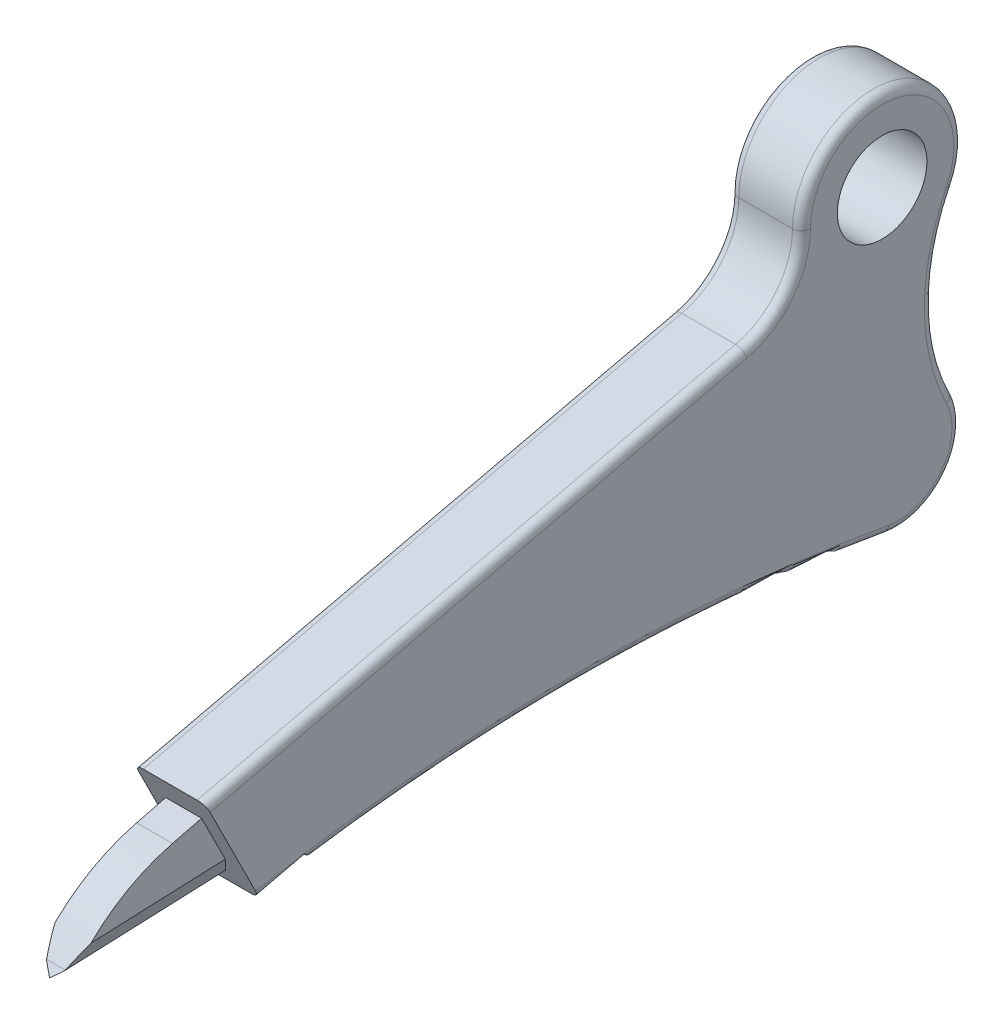
ISO-10303-21;
HEADER;
FILE_DESCRIPTION(('STEP AP214'),'2;1');
FILE_NAME('part.step','',(''),(''),'','','');
FILE_SCHEMA(('AUTOMOTIVE_DESIGN { 1 0 10303 214 1 1 1 1 }'));
ENDSEC;
DATA;
#1=APPLICATION_CONTEXT('core data for automotive mechanical design processes');
#2=APPLICATION_PROTOCOL_DEFINITION('international standard','automotive_design',2000,#1);
#3=PRODUCT_CONTEXT('',#1,'mechanical');
#4=PRODUCT('Part','Part','',(#3));
#5=PRODUCT_RELATED_PRODUCT_CATEGORY('part','',(#4));
#6=PRODUCT_DEFINITION_FORMATION('','',#4);
#7=PRODUCT_DEFINITION_CONTEXT('part definition',#1,'design');
#8=PRODUCT_DEFINITION('design','',#6,#7);
#9=PRODUCT_DEFINITION_SHAPE('','',#8);
#10=(LENGTH_UNIT() NAMED_UNIT(*) SI_UNIT(.MILLI.,.METRE.));
#11=(NAMED_UNIT(*) PLANE_ANGLE_UNIT() SI_UNIT($,.RADIAN.));
#12=(NAMED_UNIT(*) SI_UNIT($,.STERADIAN.) SOLID_ANGLE_UNIT());
#13=UNCERTAINTY_MEASURE_WITH_UNIT(LENGTH_MEASURE(1.E-05),#10,'distance_accuracy_value','');
#14=(GEOMETRIC_REPRESENTATION_CONTEXT(3) GLOBAL_UNCERTAINTY_ASSIGNED_CONTEXT((#13)) GLOBAL_UNIT_ASSIGNED_CONTEXT((#10,
#11,#12)) REPRESENTATION_CONTEXT('',''));
#15=CARTESIAN_POINT('',(0.,0.,0.));
#16=DIRECTION('',(0.,0.,1.));
#17=DIRECTION('',(1.,0.,0.));
#18=AXIS2_PLACEMENT_3D('',#15,#16,#17);
#19=CARTESIAN_POINT('',(5.08,0.,21.8621874453234));
#20=DIRECTION('',(1.,0.,0.));
#21=DIRECTION('',(0.,0.,-1.));
#22=AXIS2_PLACEMENT_3D('',#19,#20,#21);
#23=PLANE('',#22);
#24=DIRECTION('',(0.,-0.894427190999916,-0.447213595499959));
#25=VECTOR('',#24,1.);
#26=CARTESIAN_POINT('',(5.08,-43.18,88.1774609571593));
#27=LINE('',#26,#25);
#28=CARTESIAN_POINT('',(5.08,-29.1079464923485,95.2134877109851));
#29=VERTEX_POINT('',#28);
#30=CARTESIAN_POINT('',(5.08,-41.9956321296084,88.7696448923551));
#31=VERTEX_POINT('',#30);
#32=EDGE_CURVE('E330',#29,#31,#27,.T.);
#33=ORIENTED_EDGE('',*,*,#32,.T.);
#34=CARTESIAN_POINT('',(5.08,-293.260382077443,43.7274609571594));
#35=DIRECTION('',(1.,0.,0.));
#36=DIRECTION('',(0.,0.,-1.));
#37=AXIS2_PLACEMENT_3D('',#34,#35,#36);
#38=CIRCLE('',#37,255.27);
#39=CARTESIAN_POINT('',(5.08,-41.9295980896128,-0.944789042840671));
#40=VERTEX_POINT('',#39);
#41=EDGE_CURVE('E703',#31,#40,#38,.F.);
#42=ORIENTED_EDGE('',*,*,#41,.T.);
#43=CARTESIAN_POINT('',(5.08,-34.4298905377637,-2.27780844208511));
#44=DIRECTION('',(1.,0.,0.));
#45=DIRECTION('',(0.,0.,-1.));
#46=AXIS2_PLACEMENT_3D('',#43,#44,#45);
#47=CIRCLE('',#46,7.61725370996823);
#48=CARTESIAN_POINT('',(5.08,-31.0444444444444,-9.10139319141257));
#49=VERTEX_POINT('',#48);
#50=EDGE_CURVE('E225',#40,#49,#47,.T.);
#51=ORIENTED_EDGE('',*,*,#50,.T.);
#52=CARTESIAN_POINT('',(5.08,-17.78,-35.8367356911871));
#53=DIRECTION('',(1.,0.,0.));
#54=DIRECTION('',(0.,0.,-1.));
#55=AXIS2_PLACEMENT_3D('',#52,#53,#54);
#56=CIRCLE('',#55,29.845);
#57=CARTESIAN_POINT('',(5.08,-4.51555555555555,-9.10139319141259));
#58=VERTEX_POINT('',#57);
#59=EDGE_CURVE('E687',#49,#58,#56,.F.);
#60=ORIENTED_EDGE('',*,*,#59,.T.);
#61=CARTESIAN_POINT('',(5.08,0.,0.));
#62=DIRECTION('',(1.,0.,0.));
#63=DIRECTION('',(0.,0.,-1.));
#64=AXIS2_PLACEMENT_3D('',#61,#62,#63);
#65=CIRCLE('',#64,10.16);
#66=CARTESIAN_POINT('',(5.08,0.,10.16));
#67=VERTEX_POINT('',#66);
#68=EDGE_CURVE('E692',#58,#67,#65,.T.);
#69=ORIENTED_EDGE('',*,*,#68,.T.);
#70=CARTESIAN_POINT('',(5.08,0.,21.8621874453234));
#71=DIRECTION('',(1.,0.,0.));
#72=DIRECTION('',(0.,0.,-1.));
#73=AXIS2_PLACEMENT_3D('',#70,#71,#72);
#74=CIRCLE('',#73,11.7021874453234);
#75=CARTESIAN_POINT('',(5.08,-11.396864278717,19.2065000356326));
#76=VERTEX_POINT('',#75);
#77=EDGE_CURVE('E695',#67,#76,#74,.F.);
#78=ORIENTED_EDGE('',*,*,#77,.T.);
#79=DIRECTION('',(0.,-0.226939401039256,0.973908880879492));
#80=VECTOR('',#79,1.);
#81=CARTESIAN_POINT('',(5.08,-29.176864278717,95.5092479178395));
#82=LINE('',#81,#80);
#83=EDGE_CURVE('E698',#76,#29,#82,.T.);
#84=ORIENTED_EDGE('',*,*,#83,.T.);
#85=EDGE_LOOP('',(#33,#42,#51,#60,#69,#78,#84));
#86=FACE_BOUND('',#85,.T.);
#87=CARTESIAN_POINT('',(5.08,0.,0.));
#88=DIRECTION('',(1.,0.,0.));
#89=DIRECTION('',(0.,0.,-1.));
#90=AXIS2_PLACEMENT_3D('',#87,#88,#89);
#91=CIRCLE('',#90,6.35);
#92=CARTESIAN_POINT('',(5.08,0.,-6.35));
#93=VERTEX_POINT('',#92);
#94=EDGE_CURVE('E323',#93,#93,#91,.T.);
#95=ORIENTED_EDGE('',*,*,#94,.F.);
#96=EDGE_LOOP('',(#95));
#97=FACE_BOUND('',#96,.T.);
#98=ADVANCED_FACE('F33',(#86,#97),#23,.T.);
#99=CARTESIAN_POINT('',(-5.08,0.,21.8621874453234));
#100=DIRECTION('',(1.,0.,0.));
#101=DIRECTION('',(0.,0.,-1.));
#102=AXIS2_PLACEMENT_3D('',#99,#100,#101);
#103=PLANE('',#102);
#104=CARTESIAN_POINT('',(-5.08,-34.4298905377637,-2.27780844208511));
#105=DIRECTION('',(1.,0.,0.));
#106=DIRECTION('',(0.,0.,-1.));
#107=AXIS2_PLACEMENT_3D('',#104,#105,#106);
#108=CIRCLE('',#107,7.61725370996823);
#109=CARTESIAN_POINT('',(-5.08,-31.0444444444444,-9.10139319141258));
#110=VERTEX_POINT('',#109);
#111=CARTESIAN_POINT('',(-5.08,-41.9295980896128,-0.944789042840671));
#112=VERTEX_POINT('',#111);
#113=EDGE_CURVE('E357',#110,#112,#108,.F.);
#114=ORIENTED_EDGE('',*,*,#113,.T.);
#115=CARTESIAN_POINT('',(-5.08,-293.260382077443,43.7274609571594));
#116=DIRECTION('',(1.,0.,0.));
#117=DIRECTION('',(0.,0.,-1.));
#118=AXIS2_PLACEMENT_3D('',#115,#116,#117);
#119=CIRCLE('',#118,255.27);
#120=CARTESIAN_POINT('',(-5.08,-41.9956321296084,88.7696448923551));
#121=VERTEX_POINT('',#120);
#122=EDGE_CURVE('E359',#112,#121,#119,.T.);
#123=ORIENTED_EDGE('',*,*,#122,.T.);
#124=DIRECTION('',(0.,-0.894427190999916,-0.447213595499959));
#125=VECTOR('',#124,1.);
#126=CARTESIAN_POINT('',(-5.08,-43.18,88.1774609571593));
#127=LINE('',#126,#125);
#128=CARTESIAN_POINT('',(-5.08,-29.1079464923485,95.2134877109851));
#129=VERTEX_POINT('',#128);
#130=EDGE_CURVE('E326',#129,#121,#127,.T.);
#131=ORIENTED_EDGE('',*,*,#130,.F.);
#132=DIRECTION('',(0.,-0.226939401039256,0.973908880879492));
#133=VECTOR('',#132,1.);
#134=CARTESIAN_POINT('',(-5.08,-11.396864278717,19.2065000356326));
#135=LINE('',#134,#133);
#136=CARTESIAN_POINT('',(-5.08,-11.396864278717,19.2065000356326));
#137=VERTEX_POINT('',#136);
#138=EDGE_CURVE('E349',#129,#137,#135,.F.);
#139=ORIENTED_EDGE('',*,*,#138,.T.);
#140=CARTESIAN_POINT('',(-5.08,0.,21.8621874453234));
#141=DIRECTION('',(1.,0.,0.));
#142=DIRECTION('',(0.,0.,-1.));
#143=AXIS2_PLACEMENT_3D('',#140,#141,#142);
#144=CIRCLE('',#143,11.7021874453234);
#145=CARTESIAN_POINT('',(-5.08,0.,10.16));
#146=VERTEX_POINT('',#145);
#147=EDGE_CURVE('E351',#137,#146,#144,.T.);
#148=ORIENTED_EDGE('',*,*,#147,.T.);
#149=CARTESIAN_POINT('',(-5.08,0.,0.));
#150=DIRECTION('',(1.,0.,0.));
#151=DIRECTION('',(0.,0.,-1.));
#152=AXIS2_PLACEMENT_3D('',#149,#150,#151);
#153=CIRCLE('',#152,10.16);
#154=CARTESIAN_POINT('',(-5.08,-4.51555555555555,-9.10139319141259));
#155=VERTEX_POINT('',#154);
#156=EDGE_CURVE('E353',#146,#155,#153,.F.);
#157=ORIENTED_EDGE('',*,*,#156,.T.);
#158=CARTESIAN_POINT('',(-5.08,-17.78,-35.8367356911871));
#159=DIRECTION('',(1.,0.,0.));
#160=DIRECTION('',(0.,0.,-1.));
#161=AXIS2_PLACEMENT_3D('',#158,#159,#160);
#162=CIRCLE('',#161,29.845);
#163=EDGE_CURVE('E355',#155,#110,#162,.T.);
#164=ORIENTED_EDGE('',*,*,#163,.T.);
#165=EDGE_LOOP('',(#114,#123,#131,#139,#148,#157,#164));
#166=FACE_BOUND('',#165,.T.);
#167=CARTESIAN_POINT('',(-5.08,0.,0.));
#168=DIRECTION('',(1.,0.,0.));
#169=DIRECTION('',(0.,0.,-1.));
#170=AXIS2_PLACEMENT_3D('',#167,#168,#169);
#171=CIRCLE('',#170,6.35);
#172=CARTESIAN_POINT('',(-5.08,0.,-6.35));
#173=VERTEX_POINT('',#172);
#174=EDGE_CURVE('E327',#173,#173,#171,.T.);
#175=ORIENTED_EDGE('',*,*,#174,.T.);
#176=EDGE_LOOP('',(#175));
#177=FACE_BOUND('',#176,.T.);
#178=ADVANCED_FACE('F390',(#166,#177),#103,.F.);
#179=CARTESIAN_POINT('',(5.08,0.,21.8621874453234));
#180=DIRECTION('',(-1.,0.,0.));
#181=DIRECTION('',(0.,0.,1.));
#182=AXIS2_PLACEMENT_3D('',#179,#180,#181);
#183=CYLINDRICAL_SURFACE('',#182,10.4321874453234);
#184=DIRECTION('',(-1.,0.,0.));
#185=VECTOR('',#184,1.);
#186=CARTESIAN_POINT('',(5.08,0.,11.43));
#187=LINE('',#186,#185);
#188=CARTESIAN_POINT('',(3.81,0.,11.43));
#189=VERTEX_POINT('',#188);
#190=CARTESIAN_POINT('',(-3.81,0.,11.43));
#191=VERTEX_POINT('',#190);
#192=EDGE_CURVE('E333',#189,#191,#187,.T.);
#193=ORIENTED_EDGE('',*,*,#192,.T.);
#194=CARTESIAN_POINT('',(-3.81,0.,21.8621874453234));
#195=DIRECTION('',(1.,0.,0.));
#196=DIRECTION('',(0.,0.,-1.));
#197=AXIS2_PLACEMENT_3D('',#194,#195,#196);
#198=CIRCLE('',#197,10.4321874453234);
#199=CARTESIAN_POINT('',(-3.81,-10.16,19.4947130749525));
#200=VERTEX_POINT('',#199);
#201=EDGE_CURVE('E723',#191,#200,#198,.F.);
#202=ORIENTED_EDGE('',*,*,#201,.T.);
#203=DIRECTION('',(-1.,0.,0.));
#204=VECTOR('',#203,1.);
#205=CARTESIAN_POINT('',(5.08,-10.16,19.4947130749525));
#206=LINE('',#205,#204);
#207=CARTESIAN_POINT('',(3.81,-10.16,19.4947130749525));
#208=VERTEX_POINT('',#207);
#209=EDGE_CURVE('E222',#208,#200,#206,.T.);
#210=ORIENTED_EDGE('',*,*,#209,.F.);
#211=CARTESIAN_POINT('',(3.81,0.,21.8621874453234));
#212=DIRECTION('',(1.,0.,0.));
#213=DIRECTION('',(0.,0.,-1.));
#214=AXIS2_PLACEMENT_3D('',#211,#212,#213);
#215=CIRCLE('',#214,10.4321874453234);
#216=EDGE_CURVE('E735',#208,#189,#215,.T.);
#217=ORIENTED_EDGE('',*,*,#216,.T.);
#218=EDGE_LOOP('',(#193,#202,#210,#217));
#219=FACE_BOUND('',#218,.T.);
#220=ADVANCED_FACE('F387',(#219),#183,.F.);
#221=CARTESIAN_POINT('',(5.08,-27.94,95.7974609571594));
#222=DIRECTION('',(0.,-0.973908880879492,-0.226939401039256));
#223=DIRECTION('',(0.,0.226939401039256,-0.973908880879492));
#224=AXIS2_PLACEMENT_3D('',#221,#222,#223);
#225=PLANE('',#224);
#226=ORIENTED_EDGE('',*,*,#209,.T.);
#227=DIRECTION('',(0.,-0.226939401039256,0.973908880879492));
#228=VECTOR('',#227,1.);
#229=CARTESIAN_POINT('',(-3.81,-27.94,95.7974609571594));
#230=LINE('',#229,#228);
#231=CARTESIAN_POINT('',(-3.81,-27.94,95.7974609571594));
#232=VERTEX_POINT('',#231);
#233=EDGE_CURVE('E252',#200,#232,#230,.T.);
#234=ORIENTED_EDGE('',*,*,#233,.T.);
#235=DIRECTION('',(-1.,0.,0.));
#236=VECTOR('',#235,1.);
#237=CARTESIAN_POINT('',(5.08,-27.94,95.7974609571594));
#238=LINE('',#237,#236);
#239=CARTESIAN_POINT('',(3.81,-27.94,95.7974609571594));
#240=VERTEX_POINT('',#239);
#241=EDGE_CURVE('E343',#240,#232,#238,.T.);
#242=ORIENTED_EDGE('',*,*,#241,.F.);
#243=DIRECTION('',(0.,-0.226939401039256,0.973908880879492));
#244=VECTOR('',#243,1.);
#245=CARTESIAN_POINT('',(3.81,-10.16,19.4947130749525));
#246=LINE('',#245,#244);
#247=EDGE_CURVE('E705',#240,#208,#246,.F.);
#248=ORIENTED_EDGE('',*,*,#247,.T.);
#249=EDGE_LOOP('',(#226,#234,#242,#248));
#250=FACE_BOUND('',#249,.T.);
#251=ADVANCED_FACE('F382',(#250),#225,.F.);
#252=CARTESIAN_POINT('',(5.08,-43.18,88.1774609571593));
#253=DIRECTION('',(0.,0.447213595499959,-0.894427190999916));
#254=DIRECTION('',(0.,0.894427190999916,0.447213595499959));
#255=AXIS2_PLACEMENT_3D('',#252,#253,#254);
#256=PLANE('',#255);
#257=DIRECTION('',(-1.,0.,0.));
#258=VECTOR('',#257,1.);
#259=CARTESIAN_POINT('',(2.54,-31.75,93.8924609571593));
#260=LINE('',#259,#258);
#261=CARTESIAN_POINT('',(2.54,-31.75,93.8924609571593));
#262=VERTEX_POINT('',#261);
#263=CARTESIAN_POINT('',(-2.54,-31.75,93.8924609571593));
#264=VERTEX_POINT('',#263);
#265=EDGE_CURVE('E228',#262,#264,#260,.T.);
#266=ORIENTED_EDGE('',*,*,#265,.F.);
#267=DIRECTION('',(0.,-0.894427190999916,-0.447213595499959));
#268=VECTOR('',#267,1.);
#269=CARTESIAN_POINT('',(2.54,-43.18,88.1774609571593));
#270=LINE('',#269,#268);
#271=CARTESIAN_POINT('',(2.54,-38.4405814738173,90.5471702202507));
#272=VERTEX_POINT('',#271);
#273=EDGE_CURVE('E255',#262,#272,#270,.T.);
#274=ORIENTED_EDGE('',*,*,#273,.T.);
#275=DIRECTION('',(-0.391404746419297,-0.823068563112671,-0.411534281556336));
#276=VECTOR('',#275,1.);
#277=CARTESIAN_POINT('',(1.02060006747844,-41.6356636252082,88.9496291445552));
#278=LINE('',#277,#276);
#279=CARTESIAN_POINT('',(1.30009301484015,-41.0479296728491,89.2434961207348));
#280=VERTEX_POINT('',#279);
#281=EDGE_CURVE('E269',#272,#280,#278,.T.);
#282=ORIENTED_EDGE('',*,*,#281,.T.);
#283=DIRECTION('',(-0.735959609524876,-0.60554996698736,-0.302774983493681));
#284=VECTOR('',#283,1.);
#285=CARTESIAN_POINT('',(2.15970485870235,-40.3406382441677,89.5971418350755));
#286=LINE('',#285,#284);
#287=CARTESIAN_POINT('',(0.148295858459683,-41.9956321296084,88.7696448923551));
#288=VERTEX_POINT('',#287);
#289=EDGE_CURVE('E11',#280,#288,#286,.T.);
#290=ORIENTED_EDGE('',*,*,#289,.T.);
#291=DIRECTION('',(1.,0.,0.));
#292=VECTOR('',#291,1.);
#293=CARTESIAN_POINT('',(5.08,-41.9956321296084,88.7696448923551));
#294=LINE('',#293,#292);
#295=CARTESIAN_POINT('',(-0.148295858459753,-41.9956321296084,88.7696448923551));
#296=VERTEX_POINT('',#295);
#297=EDGE_CURVE('E251',#296,#288,#294,.T.);
#298=ORIENTED_EDGE('',*,*,#297,.F.);
#299=DIRECTION('',(0.735959609524873,-0.605549966987363,-0.302774983493682));
#300=VECTOR('',#299,1.);
#301=CARTESIAN_POINT('',(3.34332245731399,-44.8685470674462,87.3331874234362));
#302=LINE('',#301,#300);
#303=CARTESIAN_POINT('',(-1.30009301484011,-41.0479296728492,89.2434961207347));
#304=VERTEX_POINT('',#303);
#305=EDGE_CURVE('E42',#296,#304,#302,.F.);
#306=ORIENTED_EDGE('',*,*,#305,.T.);
#307=DIRECTION('',(0.391404746419297,-0.823068563112671,-0.411534281556336));
#308=VECTOR('',#307,1.);
#309=CARTESIAN_POINT('',(0.535888315800232,-44.9087375182733,87.3130921980227));
#310=LINE('',#309,#308);
#311=CARTESIAN_POINT('',(-2.54,-38.4405814738173,90.5471702202507));
#312=VERTEX_POINT('',#311);
#313=EDGE_CURVE('E267',#304,#312,#310,.F.);
#314=ORIENTED_EDGE('',*,*,#313,.T.);
#315=DIRECTION('',(0.,-0.894427190999916,-0.447213595499959));
#316=VECTOR('',#315,1.);
#317=CARTESIAN_POINT('',(-2.54,-43.18,88.1774609571593));
#318=LINE('',#317,#316);
#319=EDGE_CURVE('E248',#264,#312,#318,.T.);
#320=ORIENTED_EDGE('',*,*,#319,.F.);
#321=EDGE_LOOP('',(#266,#274,#282,#290,#298,#306,#314,#320));
#322=FACE_BOUND('',#321,.T.);
#323=ORIENTED_EDGE('',*,*,#130,.T.);
#324=CARTESIAN_POINT('',(-5.08,-41.9956321296084,88.7696448923552));
#325=CARTESIAN_POINT('',(-5.07999889086556,-42.0300171218377,88.7524523962405));
#326=CARTESIAN_POINT('',(-5.07839268891439,-42.0643859253171,88.7352679945008));
#327=CARTESIAN_POINT('',(-5.0719794854881,-42.1328848538347,88.701018530242));
#328=CARTESIAN_POINT('',(-5.06717237407189,-42.1670149706341,88.6839534718423));
#329=CARTESIAN_POINT('',(-5.04796917925796,-42.268706424671,88.6331077448239));
#330=CARTESIAN_POINT('',(-5.0287912178021,-42.3355974413835,88.5996622364676));
#331=CARTESIAN_POINT('',(-4.97808444180934,-42.4655619354593,88.5346799894297));
#332=CARTESIAN_POINT('',(-4.94654462941391,-42.5286319555831,88.5031449793678));
#333=CARTESIAN_POINT('',(-4.87184726223058,-42.6489892510357,88.4429663316415));
#334=CARTESIAN_POINT('',(-4.8286958376291,-42.7062795558035,88.4143211792576));
#335=CARTESIAN_POINT('',(-4.73283076181103,-42.8121461434547,88.361387885432));
#336=CARTESIAN_POINT('',(-4.68032855545628,-42.8608754576752,88.3370232283217));
#337=CARTESIAN_POINT('',(-4.56656472912219,-42.9493688176302,88.2927765483442));
#338=CARTESIAN_POINT('',(-4.50530241649127,-42.9891321537938,88.2728948802625));
#339=CARTESIAN_POINT('',(-4.37841246836569,-43.0568328413325,88.2390445364931));
#340=CARTESIAN_POINT('',(-4.31305744124052,-43.0851795881412,88.2248711630887));
#341=CARTESIAN_POINT('',(-4.17784460690513,-43.1312008962956,88.2018605090115));
#342=CARTESIAN_POINT('',(-4.10799235982862,-43.1488883660709,88.1930167741239));
#343=CARTESIAN_POINT('',(-3.9995816128375,-43.16726651312,88.1838277005994));
#344=CARTESIAN_POINT('',(-3.96183554875565,-43.1720393671845,88.1814412735671));
#345=CARTESIAN_POINT('',(-3.88606615821725,-43.1784044325297,88.1782587408945));
#346=CARTESIAN_POINT('',(-3.84804332483255,-43.18000134107,88.1774602866244));
#347=CARTESIAN_POINT('',(-3.80999999999999,-43.1799999999999,88.1774609571594));
#348=B_SPLINE_CURVE_WITH_KNOTS('',3,(#324,#325,#326,#327,#328,#329,#330,#331,#332,#333,#334,
#335,#336,#337,#338,#339,#340,#341,#342,#343,#344,#345,#346,#347),.UNSPECIFIED.,.F.,.F.,(4,2,2,
2,2,2,2,2,2,2,2,4),(0.,0.115261056802078,0.23052607266086,0.460961457806048,0.691602319411236,
0.922121655519614,1.14797063138101,1.37383747474732,1.59067023536904,1.80723988016088,
1.92145678858345,2.03550464289841),.UNSPECIFIED.);
#349=CARTESIAN_POINT('',(-3.81,-43.18,88.1774609571593));
#350=VERTEX_POINT('',#349);
#351=EDGE_CURVE('E202',#121,#350,#348,.T.);
#352=ORIENTED_EDGE('',*,*,#351,.T.);
#353=DIRECTION('',(-1.,0.,0.));
#354=VECTOR('',#353,1.);
#355=CARTESIAN_POINT('',(5.08,-43.18,88.1774609571593));
#356=LINE('',#355,#354);
#357=CARTESIAN_POINT('',(3.81,-43.18,88.1774609571593));
#358=VERTEX_POINT('',#357);
#359=EDGE_CURVE('E213',#358,#350,#356,.T.);
#360=ORIENTED_EDGE('',*,*,#359,.F.);
#361=CARTESIAN_POINT('',(3.81,-43.18,88.1774609571593));
#362=CARTESIAN_POINT('',(3.84466990764696,-43.1800004838377,88.1774607152405));
#363=CARTESIAN_POINT('',(3.87932281450361,-43.178674860689,88.1781235268148));
#364=CARTESIAN_POINT('',(3.94837229795204,-43.1733911100499,88.1807654021344));
#365=CARTESIAN_POINT('',(3.98276890761828,-43.1694333283973,88.1827442929607));
#366=CARTESIAN_POINT('',(4.08506499253537,-43.1536699912061,88.1906259615563));
#367=CARTESIAN_POINT('',(4.15226551737039,-43.1379741891178,88.1984738626005));
#368=CARTESIAN_POINT('',(4.28274177350235,-43.0967497127517,88.2190861007835));
#369=CARTESIAN_POINT('',(4.34601720825658,-43.071220296587,88.2318508088659));
#370=CARTESIAN_POINT('',(4.46700498633276,-43.0111801816584,88.2618708663301));
#371=CARTESIAN_POINT('',(4.52471649571461,-42.9766681394071,88.2791268874558));
#372=CARTESIAN_POINT('',(4.63407828584104,-42.8990744076346,88.317923753342));
#373=CARTESIAN_POINT('',(4.68560427500289,-42.8558528216647,88.339534546327));
#374=CARTESIAN_POINT('',(4.78018848577683,-42.7625403167888,88.3861907987649));
#375=CARTESIAN_POINT('',(4.82324461634758,-42.71244770673,88.4112371037943));
#376=CARTESIAN_POINT('',(4.90144545275853,-42.6047440417964,88.4650889362611));
#377=CARTESIAN_POINT('',(4.93621624217578,-42.5469159960967,88.494002959111));
#378=CARTESIAN_POINT('',(4.99485428323088,-42.4269948819536,88.5539635161825));
#379=CARTESIAN_POINT('',(5.01872177452982,-42.3649019072903,88.5850100035142));
#380=CARTESIAN_POINT('',(5.05121976503267,-42.2515787211769,88.6416715965709));
#381=CARTESIAN_POINT('',(5.06200664329423,-42.2008328035756,88.6670445553715));
#382=CARTESIAN_POINT('',(5.07639714036537,-42.0986058405164,88.7181580369011));
#383=CARTESIAN_POINT('',(5.08001096371661,-42.0471259444688,88.7438979849249));
#384=CARTESIAN_POINT('',(5.08,-41.9956321296084,88.7696448923551));
#385=B_SPLINE_CURVE_WITH_KNOTS('',3,(#361,#362,#363,#364,#365,#366,#367,#368,#369,#370,#371,
#372,#373,#374,#375,#376,#377,#378,#379,#380,#381,#382,#383,#384),.UNSPECIFIED.,.F.,.F.,(4,2,2,
2,2,2,2,2,2,2,2,4),(0.,0.10394450046553,0.207875346413036,0.415160246811974,0.622460788673012,
0.829792353297673,1.04076622011844,1.2517921070458,1.47104580299807,1.69029467938942,
1.86311255958124,2.03568440863786),.UNSPECIFIED.);
#386=EDGE_CURVE('E221',#358,#31,#385,.T.);
#387=ORIENTED_EDGE('',*,*,#386,.T.);
#388=ORIENTED_EDGE('',*,*,#32,.F.);
#389=CARTESIAN_POINT('',(3.81,-29.1079464923485,95.2134877109851));
#390=DIRECTION('',(0.,0.447213595499959,-0.894427190999916));
#391=DIRECTION('',(0.,-0.894427190999916,-0.447213595499959));
#392=AXIS2_PLACEMENT_3D('',#389,#390,#391);
#393=ELLIPSE('',#392,1.30580387548685,1.27);
#394=EDGE_CURVE('E361',#29,#240,#393,.F.);
#395=ORIENTED_EDGE('',*,*,#394,.T.);
#396=ORIENTED_EDGE('',*,*,#241,.T.);
#397=CARTESIAN_POINT('',(-3.81,-29.1079464923485,95.2134877109851));
#398=DIRECTION('',(0.,0.447213595499959,-0.894427190999916));
#399=DIRECTION('',(0.,0.894427190999916,0.447213595499959));
#400=AXIS2_PLACEMENT_3D('',#397,#398,#399);
#401=ELLIPSE('',#400,1.30580387548685,1.27);
#402=EDGE_CURVE('E363',#232,#129,#401,.F.);
#403=ORIENTED_EDGE('',*,*,#402,.T.);
#404=EDGE_LOOP('',(#323,#352,#360,#387,#388,#395,#396,#403));
#405=FACE_BOUND('',#404,.T.);
#406=ADVANCED_FACE('F300',(#322,#405),#256,.F.);
#407=CARTESIAN_POINT('',(5.08,-293.260382077443,43.7274609571594));
#408=DIRECTION('',(-1.,0.,0.));
#409=DIRECTION('',(0.,0.,1.));
#410=AXIS2_PLACEMENT_3D('',#407,#408,#409);
#411=CYLINDRICAL_SURFACE('',#410,254.);
#412=ORIENTED_EDGE('',*,*,#359,.T.);
#413=CARTESIAN_POINT('',(-3.81,-293.260382077443,43.7274609571594));
#414=DIRECTION('',(1.,0.,0.));
#415=DIRECTION('',(0.,0.,-1.));
#416=AXIS2_PLACEMENT_3D('',#413,#414,#415);
#417=CIRCLE('',#416,254.);
#418=CARTESIAN_POINT('',(-3.81,-43.18,-0.722539042840671));
#419=VERTEX_POINT('',#418);
#420=EDGE_CURVE('E212',#350,#419,#417,.F.);
#421=ORIENTED_EDGE('',*,*,#420,.T.);
#422=DIRECTION('',(-1.,0.,0.));
#423=VECTOR('',#422,1.);
#424=CARTESIAN_POINT('',(5.08,-43.18,-0.722539042840671));
#425=LINE('',#424,#423);
#426=CARTESIAN_POINT('',(3.81,-43.18,-0.722539042840671));
#427=VERTEX_POINT('',#426);
#428=EDGE_CURVE('E194',#427,#419,#425,.T.);
#429=ORIENTED_EDGE('',*,*,#428,.F.);
#430=CARTESIAN_POINT('',(3.81,-293.260382077443,43.7274609571594));
#431=DIRECTION('',(1.,0.,0.));
#432=DIRECTION('',(0.,0.,-1.));
#433=AXIS2_PLACEMENT_3D('',#430,#431,#432);
#434=CIRCLE('',#433,254.);
#435=EDGE_CURVE('E209',#427,#358,#434,.T.);
#436=ORIENTED_EDGE('',*,*,#435,.T.);
#437=EDGE_LOOP('',(#412,#421,#429,#436));
#438=FACE_BOUND('',#437,.T.);
#439=ADVANCED_FACE('F208',(#438),#411,.F.);
#440=CARTESIAN_POINT('',(5.08,-34.4298905377637,-2.27780844208511));
#441=DIRECTION('',(-1.,0.,0.));
#442=DIRECTION('',(0.,0.,1.));
#443=AXIS2_PLACEMENT_3D('',#440,#441,#442);
#444=CYLINDRICAL_SURFACE('',#443,8.88725370996823);
#445=ORIENTED_EDGE('',*,*,#428,.T.);
#446=CARTESIAN_POINT('',(-3.81,-34.4298905377637,-2.27780844208511));
#447=DIRECTION('',(1.,0.,0.));
#448=DIRECTION('',(0.,0.,-1.));
#449=AXIS2_PLACEMENT_3D('',#446,#447,#448);
#450=CIRCLE('',#449,8.88725370996823);
#451=CARTESIAN_POINT('',(-3.81,-30.48,-10.2390673403391));
#452=VERTEX_POINT('',#451);
#453=EDGE_CURVE('E201',#419,#452,#450,.T.);
#454=ORIENTED_EDGE('',*,*,#453,.T.);
#455=DIRECTION('',(-1.,0.,0.));
#456=VECTOR('',#455,1.);
#457=CARTESIAN_POINT('',(5.08,-30.48,-10.2390673403391));
#458=LINE('',#457,#456);
#459=CARTESIAN_POINT('',(3.81,-30.48,-10.2390673403391));
#460=VERTEX_POINT('',#459);
#461=EDGE_CURVE('E196',#460,#452,#458,.T.);
#462=ORIENTED_EDGE('',*,*,#461,.F.);
#463=CARTESIAN_POINT('',(3.81,-34.4298905377637,-2.27780844208511));
#464=DIRECTION('',(1.,0.,0.));
#465=DIRECTION('',(0.,0.,-1.));
#466=AXIS2_PLACEMENT_3D('',#463,#464,#465);
#467=CIRCLE('',#466,8.88725370996823);
#468=EDGE_CURVE('E191',#460,#427,#467,.F.);
#469=ORIENTED_EDGE('',*,*,#468,.T.);
#470=EDGE_LOOP('',(#445,#454,#462,#469));
#471=FACE_BOUND('',#470,.T.);
#472=ADVANCED_FACE('F193',(#471),#444,.T.);
#473=CARTESIAN_POINT('',(5.08,-17.78,-35.8367356911871));
#474=DIRECTION('',(-1.,0.,0.));
#475=DIRECTION('',(0.,0.,1.));
#476=AXIS2_PLACEMENT_3D('',#473,#474,#475);
#477=CYLINDRICAL_SURFACE('',#476,28.575);
#478=ORIENTED_EDGE('',*,*,#461,.T.);
#479=CARTESIAN_POINT('',(-3.81,-17.78,-35.8367356911871));
#480=DIRECTION('',(1.,0.,0.));
#481=DIRECTION('',(0.,0.,-1.));
#482=AXIS2_PLACEMENT_3D('',#479,#480,#481);
#483=CIRCLE('',#482,28.575);
#484=CARTESIAN_POINT('',(-3.81,-5.08,-10.2390673403392));
#485=VERTEX_POINT('',#484);
#486=EDGE_CURVE('E743',#452,#485,#483,.F.);
#487=ORIENTED_EDGE('',*,*,#486,.T.);
#488=DIRECTION('',(-1.,0.,0.));
#489=VECTOR('',#488,1.);
#490=CARTESIAN_POINT('',(5.08,-5.08,-10.2390673403392));
#491=LINE('',#490,#489);
#492=CARTESIAN_POINT('',(3.81,-5.08,-10.2390673403392));
#493=VERTEX_POINT('',#492);
#494=EDGE_CURVE('E338',#493,#485,#491,.T.);
#495=ORIENTED_EDGE('',*,*,#494,.F.);
#496=CARTESIAN_POINT('',(3.81,-17.78,-35.8367356911871));
#497=DIRECTION('',(1.,0.,0.));
#498=DIRECTION('',(0.,0.,-1.));
#499=AXIS2_PLACEMENT_3D('',#496,#497,#498);
#500=CIRCLE('',#499,28.575);
#501=EDGE_CURVE('E688',#493,#460,#500,.T.);
#502=ORIENTED_EDGE('',*,*,#501,.T.);
#503=EDGE_LOOP('',(#478,#487,#495,#502));
#504=FACE_BOUND('',#503,.T.);
#505=ADVANCED_FACE('F437',(#504),#477,.F.);
#506=CARTESIAN_POINT('',(5.08,0.,0.));
#507=DIRECTION('',(-1.,0.,0.));
#508=DIRECTION('',(0.,0.,1.));
#509=AXIS2_PLACEMENT_3D('',#506,#507,#508);
#510=CYLINDRICAL_SURFACE('',#509,11.43);
#511=ORIENTED_EDGE('',*,*,#494,.T.);
#512=CARTESIAN_POINT('',(-3.81,0.,0.));
#513=DIRECTION('',(1.,0.,0.));
#514=DIRECTION('',(0.,0.,-1.));
#515=AXIS2_PLACEMENT_3D('',#512,#513,#514);
#516=CIRCLE('',#515,11.43);
#517=EDGE_CURVE('E738',#485,#191,#516,.T.);
#518=ORIENTED_EDGE('',*,*,#517,.T.);
#519=ORIENTED_EDGE('',*,*,#192,.F.);
#520=CARTESIAN_POINT('',(3.81,0.,0.));
#521=DIRECTION('',(1.,0.,0.));
#522=DIRECTION('',(0.,0.,-1.));
#523=AXIS2_PLACEMENT_3D('',#520,#521,#522);
#524=CIRCLE('',#523,11.43);
#525=EDGE_CURVE('E691',#189,#493,#524,.F.);
#526=ORIENTED_EDGE('',*,*,#525,.T.);
#527=EDGE_LOOP('',(#511,#518,#519,#526));
#528=FACE_BOUND('',#527,.T.);
#529=ADVANCED_FACE('F420',(#528),#510,.T.);
#530=CARTESIAN_POINT('',(5.08,0.,0.));
#531=DIRECTION('',(-1.,0.,0.));
#532=DIRECTION('',(0.,0.,1.));
#533=AXIS2_PLACEMENT_3D('',#530,#531,#532);
#534=CYLINDRICAL_SURFACE('',#533,6.35);
#535=ORIENTED_EDGE('',*,*,#94,.T.);
#536=EDGE_LOOP('',(#535));
#537=FACE_BOUND('',#536,.T.);
#538=ORIENTED_EDGE('',*,*,#174,.F.);
#539=EDGE_LOOP('',(#538));
#540=FACE_BOUND('',#539,.T.);
#541=ADVANCED_FACE('F415',(#537,#540),#534,.F.);
#542=CARTESIAN_POINT('',(-3.81,-29.176864278717,95.5092479178395));
#543=DIRECTION('',(0.,-0.226939401039256,0.973908880879492));
#544=DIRECTION('',(0.,-0.973908880879492,-0.226939401039256));
#545=AXIS2_PLACEMENT_3D('',#542,#543,#544);
#546=CYLINDRICAL_SURFACE('',#545,1.27);
#547=ORIENTED_EDGE('',*,*,#402,.F.);
#548=ORIENTED_EDGE('',*,*,#233,.F.);
#549=CARTESIAN_POINT('',(-3.81,-11.396864278717,19.2065000356326));
#550=DIRECTION('',(0.,0.226939401039256,-0.973908880879492));
#551=DIRECTION('',(0.,0.973908880879492,0.226939401039256));
#552=AXIS2_PLACEMENT_3D('',#549,#550,#551);
#553=CIRCLE('',#552,1.27);
#554=EDGE_CURVE('E236',#137,#200,#553,.T.);
#555=ORIENTED_EDGE('',*,*,#554,.F.);
#556=ORIENTED_EDGE('',*,*,#138,.F.);
#557=EDGE_LOOP('',(#547,#548,#555,#556));
#558=FACE_BOUND('',#557,.T.);
#559=ADVANCED_FACE('F412',(#558),#546,.T.);
#560=CARTESIAN_POINT('',(-3.81,0.,21.8621874453234));
#561=DIRECTION('',(1.,0.,0.));
#562=DIRECTION('',(0.,0.,-1.));
#563=AXIS2_PLACEMENT_3D('',#560,#561,#562);
#564=TOROIDAL_SURFACE('',#563,11.7021874453234,1.27);
#565=ORIENTED_EDGE('',*,*,#554,.T.);
#566=ORIENTED_EDGE('',*,*,#201,.F.);
#567=CARTESIAN_POINT('',(-3.81,0.,10.16));
#568=DIRECTION('',(0.,1.,0.));
#569=DIRECTION('',(0.,0.,1.));
#570=AXIS2_PLACEMENT_3D('',#567,#568,#569);
#571=CIRCLE('',#570,1.27);
#572=EDGE_CURVE('E714',#146,#191,#571,.T.);
#573=ORIENTED_EDGE('',*,*,#572,.F.);
#574=ORIENTED_EDGE('',*,*,#147,.F.);
#575=EDGE_LOOP('',(#565,#566,#573,#574));
#576=FACE_BOUND('',#575,.T.);
#577=ADVANCED_FACE('F409',(#576),#564,.T.);
#578=CARTESIAN_POINT('',(-3.81,0.,0.));
#579=DIRECTION('',(1.,0.,0.));
#580=DIRECTION('',(0.,0.,-1.));
#581=AXIS2_PLACEMENT_3D('',#578,#579,#580);
#582=TOROIDAL_SURFACE('',#581,10.16,1.27);
#583=ORIENTED_EDGE('',*,*,#572,.T.);
#584=ORIENTED_EDGE('',*,*,#517,.F.);
#585=CARTESIAN_POINT('',(-3.81,-4.51555555555555,-9.10139319141259));
#586=DIRECTION('',(0.,-0.895806416477616,0.444444444444445));
#587=DIRECTION('',(0.,-0.444444444444445,-0.895806416477617));
#588=AXIS2_PLACEMENT_3D('',#585,#586,#587);
#589=CIRCLE('',#588,1.27);
#590=EDGE_CURVE('E712',#155,#485,#589,.T.);
#591=ORIENTED_EDGE('',*,*,#590,.F.);
#592=ORIENTED_EDGE('',*,*,#156,.F.);
#593=EDGE_LOOP('',(#583,#584,#591,#592));
#594=FACE_BOUND('',#593,.T.);
#595=ADVANCED_FACE('F405',(#594),#582,.T.);
#596=CARTESIAN_POINT('',(-3.81,-17.78,-35.8367356911871));
#597=DIRECTION('',(1.,0.,0.));
#598=DIRECTION('',(0.,0.,-1.));
#599=AXIS2_PLACEMENT_3D('',#596,#597,#598);
#600=TOROIDAL_SURFACE('',#599,29.845,1.27);
#601=ORIENTED_EDGE('',*,*,#590,.T.);
#602=ORIENTED_EDGE('',*,*,#486,.F.);
#603=CARTESIAN_POINT('',(-3.81,-31.0444444444444,-9.10139319141258));
#604=DIRECTION('',(0.,-0.895806416477616,-0.444444444444445));
#605=DIRECTION('',(0.,0.444444444444445,-0.895806416477616));
#606=AXIS2_PLACEMENT_3D('',#603,#604,#605);
#607=CIRCLE('',#606,1.27);
#608=EDGE_CURVE('E709',#110,#452,#607,.T.);
#609=ORIENTED_EDGE('',*,*,#608,.F.);
#610=ORIENTED_EDGE('',*,*,#163,.F.);
#611=EDGE_LOOP('',(#601,#602,#609,#610));
#612=FACE_BOUND('',#611,.T.);
#613=ADVANCED_FACE('F401',(#612),#600,.T.);
#614=CARTESIAN_POINT('',(-3.81,-34.4298905377637,-2.27780844208511));
#615=DIRECTION('',(1.,0.,0.));
#616=DIRECTION('',(0.,0.,-1.));
#617=AXIS2_PLACEMENT_3D('',#614,#615,#616);
#618=TOROIDAL_SURFACE('',#617,7.61725370996823,1.27);
#619=ORIENTED_EDGE('',*,*,#608,.T.);
#620=ORIENTED_EDGE('',*,*,#453,.F.);
#621=CARTESIAN_POINT('',(-3.81,-41.9295980896128,-0.944789042840671));
#622=DIRECTION('',(0.,0.175000000000001,0.984568433375761));
#623=DIRECTION('',(0.,-0.984568433375761,0.175000000000001));
#624=AXIS2_PLACEMENT_3D('',#621,#622,#623);
#625=CIRCLE('',#624,1.27);
#626=EDGE_CURVE('E247',#112,#419,#625,.T.);
#627=ORIENTED_EDGE('',*,*,#626,.F.);
#628=ORIENTED_EDGE('',*,*,#113,.F.);
#629=EDGE_LOOP('',(#619,#620,#627,#628));
#630=FACE_BOUND('',#629,.T.);
#631=ADVANCED_FACE('F397',(#630),#618,.T.);
#632=CARTESIAN_POINT('',(-3.81,-293.260382077443,43.7274609571594));
#633=DIRECTION('',(1.,0.,0.));
#634=DIRECTION('',(0.,0.,-1.));
#635=AXIS2_PLACEMENT_3D('',#632,#633,#634);
#636=TOROIDAL_SURFACE('',#635,255.27,1.27);
#637=ORIENTED_EDGE('',*,*,#351,.F.);
#638=ORIENTED_EDGE('',*,*,#122,.F.);
#639=ORIENTED_EDGE('',*,*,#626,.T.);
#640=ORIENTED_EDGE('',*,*,#420,.F.);
#641=EDGE_LOOP('',(#637,#638,#639,#640));
#642=FACE_BOUND('',#641,.T.);
#643=ADVANCED_FACE('F392',(#642),#636,.T.);
#644=CARTESIAN_POINT('',(3.81,-11.396864278717,19.2065000356326));
#645=DIRECTION('',(0.,0.226939401039256,-0.973908880879492));
#646=DIRECTION('',(0.,0.973908880879492,0.226939401039256));
#647=AXIS2_PLACEMENT_3D('',#644,#645,#646);
#648=CYLINDRICAL_SURFACE('',#647,1.27);
#649=ORIENTED_EDGE('',*,*,#394,.F.);
#650=ORIENTED_EDGE('',*,*,#83,.F.);
#651=CARTESIAN_POINT('',(3.81,-11.396864278717,19.2065000356326));
#652=DIRECTION('',(0.,0.226939401039256,-0.973908880879492));
#653=DIRECTION('',(0.,0.973908880879492,0.226939401039256));
#654=AXIS2_PLACEMENT_3D('',#651,#652,#653);
#655=CIRCLE('',#654,1.27);
#656=EDGE_CURVE('E244',#208,#76,#655,.T.);
#657=ORIENTED_EDGE('',*,*,#656,.F.);
#658=ORIENTED_EDGE('',*,*,#247,.F.);
#659=EDGE_LOOP('',(#649,#650,#657,#658));
#660=FACE_BOUND('',#659,.T.);
#661=ADVANCED_FACE('F396',(#660),#648,.T.);
#662=CARTESIAN_POINT('',(3.81,0.,21.8621874453234));
#663=DIRECTION('',(1.,0.,0.));
#664=DIRECTION('',(0.,0.,-1.));
#665=AXIS2_PLACEMENT_3D('',#662,#663,#664);
#666=TOROIDAL_SURFACE('',#665,11.7021874453234,1.27);
#667=ORIENTED_EDGE('',*,*,#656,.T.);
#668=ORIENTED_EDGE('',*,*,#77,.F.);
#669=CARTESIAN_POINT('',(3.81,0.,10.16));
#670=DIRECTION('',(0.,1.,0.));
#671=DIRECTION('',(0.,0.,1.));
#672=AXIS2_PLACEMENT_3D('',#669,#670,#671);
#673=CIRCLE('',#672,1.27);
#674=EDGE_CURVE('E241',#189,#67,#673,.T.);
#675=ORIENTED_EDGE('',*,*,#674,.F.);
#676=ORIENTED_EDGE('',*,*,#216,.F.);
#677=EDGE_LOOP('',(#667,#668,#675,#676));
#678=FACE_BOUND('',#677,.T.);
#679=ADVANCED_FACE('F542',(#678),#666,.T.);
#680=CARTESIAN_POINT('',(3.81,0.,0.));
#681=DIRECTION('',(1.,0.,0.));
#682=DIRECTION('',(0.,0.,-1.));
#683=AXIS2_PLACEMENT_3D('',#680,#681,#682);
#684=TOROIDAL_SURFACE('',#683,10.16,1.27);
#685=ORIENTED_EDGE('',*,*,#674,.T.);
#686=ORIENTED_EDGE('',*,*,#68,.F.);
#687=CARTESIAN_POINT('',(3.81,-4.51555555555555,-9.10139319141259));
#688=DIRECTION('',(0.,-0.895806416477617,0.444444444444444));
#689=DIRECTION('',(0.,-0.444444444444444,-0.895806416477617));
#690=AXIS2_PLACEMENT_3D('',#687,#688,#689);
#691=CIRCLE('',#690,1.27);
#692=EDGE_CURVE('E230',#493,#58,#691,.T.);
#693=ORIENTED_EDGE('',*,*,#692,.F.);
#694=ORIENTED_EDGE('',*,*,#525,.F.);
#695=EDGE_LOOP('',(#685,#686,#693,#694));
#696=FACE_BOUND('',#695,.T.);
#697=ADVANCED_FACE('F552',(#696),#684,.T.);
#698=CARTESIAN_POINT('',(3.81,-17.78,-35.8367356911871));
#699=DIRECTION('',(1.,0.,0.));
#700=DIRECTION('',(0.,0.,-1.));
#701=AXIS2_PLACEMENT_3D('',#698,#699,#700);
#702=TOROIDAL_SURFACE('',#701,29.845,1.27);
#703=ORIENTED_EDGE('',*,*,#692,.T.);
#704=ORIENTED_EDGE('',*,*,#59,.F.);
#705=CARTESIAN_POINT('',(3.81,-31.0444444444444,-9.10139319141258));
#706=DIRECTION('',(0.,-0.895806416477617,-0.444444444444444));
#707=DIRECTION('',(0.,0.444444444444444,-0.895806416477617));
#708=AXIS2_PLACEMENT_3D('',#705,#706,#707);
#709=CIRCLE('',#708,1.27);
#710=EDGE_CURVE('E227',#460,#49,#709,.T.);
#711=ORIENTED_EDGE('',*,*,#710,.F.);
#712=ORIENTED_EDGE('',*,*,#501,.F.);
#713=EDGE_LOOP('',(#703,#704,#711,#712));
#714=FACE_BOUND('',#713,.T.);
#715=ADVANCED_FACE('F562',(#714),#702,.T.);
#716=CARTESIAN_POINT('',(3.81,-34.4298905377637,-2.27780844208511));
#717=DIRECTION('',(1.,0.,0.));
#718=DIRECTION('',(0.,0.,-1.));
#719=AXIS2_PLACEMENT_3D('',#716,#717,#718);
#720=TOROIDAL_SURFACE('',#719,7.61725370996823,1.27);
#721=ORIENTED_EDGE('',*,*,#710,.T.);
#722=ORIENTED_EDGE('',*,*,#50,.F.);
#723=CARTESIAN_POINT('',(3.81,-41.9295980896128,-0.94478904284067));
#724=DIRECTION('',(0.,0.175,0.984568433375761));
#725=DIRECTION('',(0.,-0.984568433375761,0.175));
#726=AXIS2_PLACEMENT_3D('',#723,#724,#725);
#727=CIRCLE('',#726,1.27);
#728=EDGE_CURVE('E219',#427,#40,#727,.T.);
#729=ORIENTED_EDGE('',*,*,#728,.F.);
#730=ORIENTED_EDGE('',*,*,#468,.F.);
#731=EDGE_LOOP('',(#721,#722,#729,#730));
#732=FACE_BOUND('',#731,.T.);
#733=ADVANCED_FACE('F224',(#732),#720,.T.);
#734=CARTESIAN_POINT('',(3.81,-293.260382077443,43.7274609571594));
#735=DIRECTION('',(1.,0.,0.));
#736=DIRECTION('',(0.,0.,-1.));
#737=AXIS2_PLACEMENT_3D('',#734,#735,#736);
#738=TOROIDAL_SURFACE('',#737,255.27,1.27);
#739=ORIENTED_EDGE('',*,*,#386,.F.);
#740=ORIENTED_EDGE('',*,*,#435,.F.);
#741=ORIENTED_EDGE('',*,*,#728,.T.);
#742=ORIENTED_EDGE('',*,*,#41,.F.);
#743=EDGE_LOOP('',(#739,#740,#741,#742));
#744=FACE_BOUND('',#743,.T.);
#745=ADVANCED_FACE('F217',(#744),#738,.T.);
#746=CARTESIAN_POINT('',(2.54,-42.3396621923954,92.6224609571593));
#747=DIRECTION('',(0.,0.996037049703504,0.0889392805117098));
#748=DIRECTION('',(0.,-0.0889392805117098,0.996037049703503));
#749=AXIS2_PLACEMENT_3D('',#746,#747,#748);
#750=PLANE('',#749);
#751=DIRECTION('',(-0.0567635372511808,-0.0887958793147215,0.994431089948147));
#752=VECTOR('',#751,1.);
#753=CARTESIAN_POINT('',(-1.22287566059538,-44.1405721143565,112.790973622559));
#754=LINE('',#753,#752);
#755=CARTESIAN_POINT('',(0.,-42.2276131122662,91.3676156902343));
#756=VERTEX_POINT('',#755);
#757=EDGE_CURVE('E285',#288,#756,#754,.T.);
#758=ORIENTED_EDGE('',*,*,#757,.T.);
#759=DIRECTION('',(0.0567635372511802,-0.0887958793147215,0.994431089948147));
#760=VECTOR('',#759,1.);
#761=CARTESIAN_POINT('',(1.22287566059529,-44.1405721143565,112.790973622559));
#762=LINE('',#761,#760);
#763=EDGE_CURVE('E287',#756,#296,#762,.F.);
#764=ORIENTED_EDGE('',*,*,#763,.T.);
#765=ORIENTED_EDGE('',*,*,#297,.T.);
#766=EDGE_LOOP('',(#758,#764,#765));
#767=FACE_BOUND('',#766,.T.);
#768=ADVANCED_FACE('F588',(#767),#750,.F.);
#769=CARTESIAN_POINT('',(2.54,0.,0.));
#770=DIRECTION('',(1.,0.,0.));
#771=DIRECTION('',(0.,0.,-1.));
#772=AXIS2_PLACEMENT_3D('',#769,#770,#771);
#773=PLANE('',#772);
#774=DIRECTION('',(0.,-0.242535625036333,0.970142500145332));
#775=VECTOR('',#774,1.);
#776=CARTESIAN_POINT('',(2.54,-31.75,93.8924609571593));
#777=LINE('',#776,#775);
#778=CARTESIAN_POINT('',(2.54,-32.7800115229941,98.0125070491356));
#779=VERTEX_POINT('',#778);
#780=EDGE_CURVE('E233',#262,#779,#777,.T.);
#781=ORIENTED_EDGE('',*,*,#780,.T.);
#782=CARTESIAN_POINT('',(2.54,-57.4216310266855,91.8521021732128));
#783=DIRECTION('',(1.,0.,0.));
#784=DIRECTION('',(0.,0.,-1.));
#785=AXIS2_PLACEMENT_3D('',#782,#783,#784);
#786=CIRCLE('',#785,25.4);
#787=CARTESIAN_POINT('',(2.54,-39.2275200707063,109.57593715669));
#788=VERTEX_POINT('',#787);
#789=EDGE_CURVE('E280',#779,#788,#786,.T.);
#790=ORIENTED_EDGE('',*,*,#789,.T.);
#791=DIRECTION('',(0.,0.0413198884269569,-0.999145968725483));
#792=VECTOR('',#791,1.);
#793=CARTESIAN_POINT('',(2.54,-38.5329160515513,92.7798897320661));
#794=LINE('',#793,#792);
#795=EDGE_CURVE('E265',#788,#272,#794,.T.);
#796=ORIENTED_EDGE('',*,*,#795,.T.);
#797=ORIENTED_EDGE('',*,*,#273,.F.);
#798=EDGE_LOOP('',(#781,#790,#796,#797));
#799=FACE_BOUND('',#798,.T.);
#800=ADVANCED_FACE('F594',(#799),#773,.T.);
#801=CARTESIAN_POINT('',(-2.54,0.,0.));
#802=DIRECTION('',(1.,0.,0.));
#803=DIRECTION('',(0.,0.,-1.));
#804=AXIS2_PLACEMENT_3D('',#801,#802,#803);
#805=PLANE('',#804);
#806=DIRECTION('',(0.,-0.0413198884269569,0.999145968725483));
#807=VECTOR('',#806,1.);
#808=CARTESIAN_POINT('',(-2.54,-34.6367468944774,-1.4324098399538));
#809=LINE('',#808,#807);
#810=CARTESIAN_POINT('',(-2.54,-39.2275200707063,109.57593715669));
#811=VERTEX_POINT('',#810);
#812=EDGE_CURVE('E258',#312,#811,#809,.T.);
#813=ORIENTED_EDGE('',*,*,#812,.T.);
#814=CARTESIAN_POINT('',(-2.54,-57.4216310266855,91.8521021732128));
#815=DIRECTION('',(1.,0.,0.));
#816=DIRECTION('',(0.,0.,-1.));
#817=AXIS2_PLACEMENT_3D('',#814,#815,#816);
#818=CIRCLE('',#817,25.4);
#819=CARTESIAN_POINT('',(-2.54,-32.7800115229941,98.0125070491356));
#820=VERTEX_POINT('',#819);
#821=EDGE_CURVE('E276',#811,#820,#818,.F.);
#822=ORIENTED_EDGE('',*,*,#821,.T.);
#823=DIRECTION('',(0.,-0.242535625036333,0.970142500145332));
#824=VECTOR('',#823,1.);
#825=CARTESIAN_POINT('',(-2.54,-31.75,93.8924609571593));
#826=LINE('',#825,#824);
#827=EDGE_CURVE('E314',#264,#820,#826,.T.);
#828=ORIENTED_EDGE('',*,*,#827,.F.);
#829=ORIENTED_EDGE('',*,*,#319,.T.);
#830=EDGE_LOOP('',(#813,#822,#828,#829));
#831=FACE_BOUND('',#830,.T.);
#832=ADVANCED_FACE('F599',(#831),#805,.F.);
#833=CARTESIAN_POINT('',(2.54,-31.75,93.8924609571593));
#834=DIRECTION('',(0.,-0.970142500145332,-0.242535625036333));
#835=DIRECTION('',(0.,0.242535625036333,-0.970142500145332));
#836=AXIS2_PLACEMENT_3D('',#833,#834,#835);
#837=PLANE('',#836);
#838=ORIENTED_EDGE('',*,*,#827,.T.);
#839=DIRECTION('',(-1.,0.,0.));
#840=VECTOR('',#839,1.);
#841=CARTESIAN_POINT('',(2.54,-32.7800115229941,98.0125070491356));
#842=LINE('',#841,#840);
#843=EDGE_CURVE('E278',#820,#779,#842,.F.);
#844=ORIENTED_EDGE('',*,*,#843,.T.);
#845=ORIENTED_EDGE('',*,*,#780,.F.);
#846=ORIENTED_EDGE('',*,*,#265,.T.);
#847=EDGE_LOOP('',(#838,#844,#845,#846));
#848=FACE_BOUND('',#847,.T.);
#849=ADVANCED_FACE('F609',(#848),#837,.F.);
#850=CARTESIAN_POINT('',(2.54,-34.925,106.592460957159));
#851=DIRECTION('',(0.,-0.609710760849692,-0.7926239891046));
#852=DIRECTION('',(0.,0.7926239891046,-0.609710760849692));
#853=AXIS2_PLACEMENT_3D('',#850,#851,#852);
#854=PLANE('',#853);
#855=DIRECTION('',(-0.33667070999745,0.7463525403128,-0.574117338702153));
#856=VECTOR('',#855,1.);
#857=CARTESIAN_POINT('',(-0.763367822429451,-43.18,112.942460957159));
#858=LINE('',#857,#856);
#859=CARTESIAN_POINT('',(-1.32498250006761,-41.9349777011033,111.98475149647));
#860=VERTEX_POINT('',#859);
#861=CARTESIAN_POINT('',(-1.30009301484011,-41.9901542578248,112.02719500164));
#862=VERTEX_POINT('',#861);
#863=EDGE_CURVE('E263',#860,#862,#858,.F.);
#864=ORIENTED_EDGE('',*,*,#863,.T.);
#865=DIRECTION('',(-0.674566510129782,0.585126186487527,-0.450097066528866));
#866=VECTOR('',#865,1.);
#867=CARTESIAN_POINT('',(0.0716283478800379,-43.18,112.942460957159));
#868=LINE('',#867,#866);
#869=CARTESIAN_POINT('',(0.,-43.1178688069892,112.894667731766));
#870=VERTEX_POINT('',#869);
#871=EDGE_CURVE('E57',#862,#870,#868,.F.);
#872=ORIENTED_EDGE('',*,*,#871,.T.);
#873=DIRECTION('',(0.674566510129786,0.585126186487524,-0.450097066528864));
#874=VECTOR('',#873,1.);
#875=CARTESIAN_POINT('',(-0.0716283478801112,-43.18,112.942460957159));
#876=LINE('',#875,#874);
#877=CARTESIAN_POINT('',(1.30009301484016,-41.9901542578247,112.02719500164));
#878=VERTEX_POINT('',#877);
#879=EDGE_CURVE('E292',#870,#878,#876,.T.);
#880=ORIENTED_EDGE('',*,*,#879,.T.);
#881=DIRECTION('',(0.33667070999745,0.7463525403128,-0.574117338702153));
#882=VECTOR('',#881,1.);
#883=CARTESIAN_POINT('',(25.2187966133351,11.0343134538477,71.2391429157381));
#884=LINE('',#883,#882);
#885=CARTESIAN_POINT('',(1.32498250006762,-41.9349777011033,111.98475149647));
#886=VERTEX_POINT('',#885);
#887=EDGE_CURVE('E261',#878,#886,#884,.T.);
#888=ORIENTED_EDGE('',*,*,#887,.T.);
#889=DIRECTION('',(-1.,0.,0.));
#890=VECTOR('',#889,1.);
#891=CARTESIAN_POINT('',(2.54,-41.9349777011033,111.98475149647));
#892=LINE('',#891,#890);
#893=EDGE_CURVE('E271',#886,#860,#892,.T.);
#894=ORIENTED_EDGE('',*,*,#893,.T.);
#895=EDGE_LOOP('',(#864,#872,#880,#888,#894));
#896=FACE_BOUND('',#895,.T.);
#897=ADVANCED_FACE('F618',(#896),#854,.F.);
#898=CARTESIAN_POINT('',(-0.763367822429451,-43.18,112.942460957159));
#899=DIRECTION('',(0.906307787036651,0.422257332527989,0.0174625394223201));
#900=DIRECTION('',(0.,0.0413198884269569,-0.999145968725483));
#901=AXIS2_PLACEMENT_3D('',#898,#899,#900);
#902=PLANE('',#901);
#903=ORIENTED_EDGE('',*,*,#313,.F.);
#904=DIRECTION('',(0.,0.0413198884269569,-0.999145968725483));
#905=VECTOR('',#904,1.);
#906=CARTESIAN_POINT('',(-1.30009301484011,-42.0299721097605,112.990020598693));
#907=LINE('',#906,#905);
#908=EDGE_CURVE('E289',#304,#862,#907,.F.);
#909=ORIENTED_EDGE('',*,*,#908,.T.);
#910=ORIENTED_EDGE('',*,*,#863,.F.);
#911=CARTESIAN_POINT('',(6.27830658570793,-57.4216310266855,91.8521021732128));
#912=DIRECTION('',(0.906307787036651,0.422257332527989,0.0174625394223201));
#913=DIRECTION('',(-0.422618261740698,0.905533771842183,0.0374485366408367));
#914=AXIS2_PLACEMENT_3D('',#911,#912,#913);
#915=ELLIPSE('',#914,28.0257991416473,25.4);
#916=EDGE_CURVE('E274',#860,#811,#915,.F.);
#917=ORIENTED_EDGE('',*,*,#916,.T.);
#918=ORIENTED_EDGE('',*,*,#812,.F.);
#919=EDGE_LOOP('',(#903,#909,#910,#917,#918));
#920=FACE_BOUND('',#919,.T.);
#921=ADVANCED_FACE('F307',(#920),#902,.F.);
#922=CARTESIAN_POINT('',(2.54,-34.6367468944774,-1.4324098399538));
#923=DIRECTION('',(0.906307787036651,-0.422257332527989,-0.0174625394223201));
#924=DIRECTION('',(0.,-0.0413198884269569,0.999145968725483));
#925=AXIS2_PLACEMENT_3D('',#922,#923,#924);
#926=PLANE('',#925);
#927=ORIENTED_EDGE('',*,*,#887,.F.);
#928=DIRECTION('',(0.,0.041319888426957,-0.999145968725483));
#929=VECTOR('',#928,1.);
#930=CARTESIAN_POINT('',(1.30009301484015,-41.1896343021558,92.6700205986932));
#931=LINE('',#930,#929);
#932=EDGE_CURVE('E49',#878,#280,#931,.T.);
#933=ORIENTED_EDGE('',*,*,#932,.T.);
#934=ORIENTED_EDGE('',*,*,#281,.F.);
#935=ORIENTED_EDGE('',*,*,#795,.F.);
#936=CARTESIAN_POINT('',(-6.27830658570793,-57.4216310266855,91.8521021732128));
#937=DIRECTION('',(0.906307787036651,-0.422257332527989,-0.0174625394223201));
#938=DIRECTION('',(-0.422618261740698,-0.905533771842183,-0.0374485366408367));
#939=AXIS2_PLACEMENT_3D('',#936,#937,#938);
#940=ELLIPSE('',#939,28.0257991416473,25.4);
#941=EDGE_CURVE('E282',#788,#886,#940,.T.);
#942=ORIENTED_EDGE('',*,*,#941,.T.);
#943=EDGE_LOOP('',(#927,#933,#934,#935,#942));
#944=FACE_BOUND('',#943,.T.);
#945=ADVANCED_FACE('F628',(#944),#926,.T.);
#946=CARTESIAN_POINT('',(2.54,-57.4216310266855,91.8521021732128));
#947=DIRECTION('',(-1.,0.,0.));
#948=DIRECTION('',(0.,0.,1.));
#949=AXIS2_PLACEMENT_3D('',#946,#947,#948);
#950=CYLINDRICAL_SURFACE('',#949,25.4);
#951=ORIENTED_EDGE('',*,*,#789,.F.);
#952=ORIENTED_EDGE('',*,*,#843,.F.);
#953=ORIENTED_EDGE('',*,*,#821,.F.);
#954=ORIENTED_EDGE('',*,*,#916,.F.);
#955=ORIENTED_EDGE('',*,*,#893,.F.);
#956=ORIENTED_EDGE('',*,*,#941,.F.);
#957=EDGE_LOOP('',(#951,#952,#953,#954,#955,#956));
#958=FACE_BOUND('',#957,.T.);
#959=ADVANCED_FACE('F624',(#958),#950,.T.);
#960=CARTESIAN_POINT('',(-0.0716283478801112,-43.18,112.942460957159));
#961=DIRECTION('',(0.642787609686542,-0.765390217206883,-0.0316528709197665));
#962=DIRECTION('',(0.,0.0413198884269569,-0.999145968725483));
#963=AXIS2_PLACEMENT_3D('',#960,#961,#962);
#964=PLANE('',#963);
#965=ORIENTED_EDGE('',*,*,#932,.F.);
#966=ORIENTED_EDGE('',*,*,#879,.F.);
#967=DIRECTION('',(0.,0.0413198884269569,-0.999145968725483));
#968=VECTOR('',#967,1.);
#969=CARTESIAN_POINT('',(0.,-43.1199480098272,112.944944419648));
#970=LINE('',#969,#968);
#971=EDGE_CURVE('E37',#756,#870,#970,.F.);
#972=ORIENTED_EDGE('',*,*,#971,.F.);
#973=ORIENTED_EDGE('',*,*,#757,.F.);
#974=ORIENTED_EDGE('',*,*,#289,.F.);
#975=EDGE_LOOP('',(#965,#966,#972,#973,#974));
#976=FACE_BOUND('',#975,.T.);
#977=ADVANCED_FACE('F35',(#976),#964,.T.);
#978=CARTESIAN_POINT('',(0.0716283478800379,-43.18,112.942460957159));
#979=DIRECTION('',(0.642787609686546,0.765390217206879,0.0316528709197663));
#980=DIRECTION('',(0.,0.0413198884269569,-0.999145968725483));
#981=AXIS2_PLACEMENT_3D('',#978,#979,#980);
#982=PLANE('',#981);
#983=ORIENTED_EDGE('',*,*,#871,.F.);
#984=ORIENTED_EDGE('',*,*,#908,.F.);
#985=ORIENTED_EDGE('',*,*,#305,.F.);
#986=ORIENTED_EDGE('',*,*,#763,.F.);
#987=ORIENTED_EDGE('',*,*,#971,.T.);
#988=EDGE_LOOP('',(#983,#984,#985,#986,#987));
#989=FACE_BOUND('',#988,.T.);
#990=ADVANCED_FACE('F309',(#989),#982,.F.);
#991=CLOSED_SHELL('',(#98,#178,#220,#251,#406,#439,#472,#505,#529,#541,#559,#577,#595,#613,#631,
#643,#661,#679,#697,#715,#733,#745,#768,#800,#832,#849,#897,#921,#945,#959,#977,#990));
#992=MANIFOLD_SOLID_BREP('B2',#991);
#993=ADVANCED_BREP_SHAPE_REPRESENTATION('',(#18,#992),#14);
#994=SHAPE_DEFINITION_REPRESENTATION(#9,#993);
ENDSEC;
END-ISO-10303-21;
